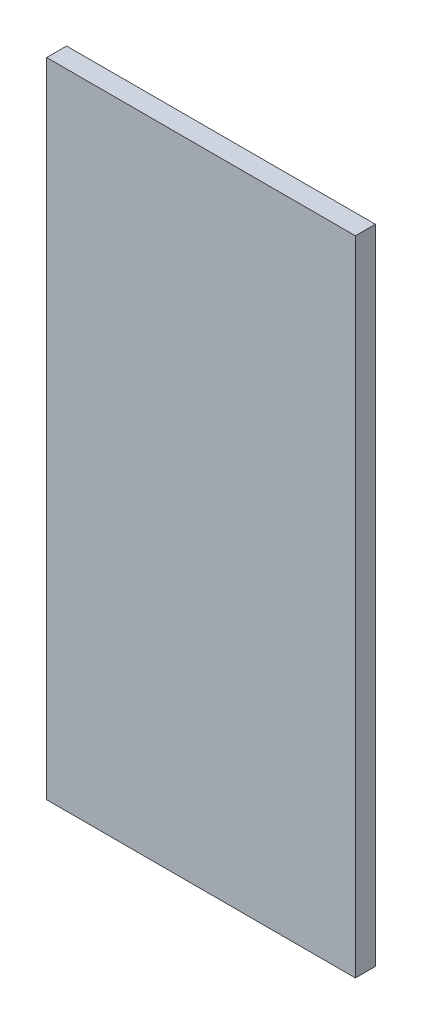
ISO-10303-21;
HEADER;
FILE_DESCRIPTION(('STEP AP214'),'2;1');
FILE_NAME('part.step','',(''),(''),'','','');
FILE_SCHEMA(('AUTOMOTIVE_DESIGN { 1 0 10303 214 1 1 1 1 }'));
ENDSEC;
DATA;
#1=APPLICATION_CONTEXT('core data for automotive mechanical design processes');
#2=APPLICATION_PROTOCOL_DEFINITION('international standard','automotive_design',2000,#1);
#3=PRODUCT_CONTEXT('',#1,'mechanical');
#4=PRODUCT('Part','Part','',(#3));
#5=PRODUCT_RELATED_PRODUCT_CATEGORY('part','',(#4));
#6=PRODUCT_DEFINITION_FORMATION('','',#4);
#7=PRODUCT_DEFINITION_CONTEXT('part definition',#1,'design');
#8=PRODUCT_DEFINITION('design','',#6,#7);
#9=PRODUCT_DEFINITION_SHAPE('','',#8);
#10=(LENGTH_UNIT() NAMED_UNIT(*) SI_UNIT(.MILLI.,.METRE.));
#11=(NAMED_UNIT(*) PLANE_ANGLE_UNIT() SI_UNIT($,.RADIAN.));
#12=(NAMED_UNIT(*) SI_UNIT($,.STERADIAN.) SOLID_ANGLE_UNIT());
#13=UNCERTAINTY_MEASURE_WITH_UNIT(LENGTH_MEASURE(1.E-05),#10,'distance_accuracy_value','');
#14=(GEOMETRIC_REPRESENTATION_CONTEXT(3) GLOBAL_UNCERTAINTY_ASSIGNED_CONTEXT((#13)) GLOBAL_UNIT_ASSIGNED_CONTEXT((#10,
#11,#12)) REPRESENTATION_CONTEXT('',''));
#15=CARTESIAN_POINT('',(0.,0.,0.));
#16=DIRECTION('',(0.,0.,1.));
#17=DIRECTION('',(1.,0.,0.));
#18=AXIS2_PLACEMENT_3D('',#15,#16,#17);
#19=CARTESIAN_POINT('',(90.2419967651367,102.857002258301,0.));
#20=DIRECTION('',(1.,0.,0.));
#21=DIRECTION('',(0.,-1.,0.));
#22=AXIS2_PLACEMENT_3D('',#19,#20,#21);
#23=PLANE('',#22);
#24=DIRECTION('',(0.,-1.,0.));
#25=VECTOR('',#24,1.);
#26=CARTESIAN_POINT('',(90.2419967651367,102.857002258301,0.03556));
#27=LINE('',#26,#25);
#28=CARTESIAN_POINT('',(90.2419967651367,102.857002258301,0.03556));
#29=VERTEX_POINT('',#28);
#30=CARTESIAN_POINT('',(90.2419967651367,101.71199798584,0.03556));
#31=VERTEX_POINT('',#30);
#32=EDGE_CURVE('E11',#29,#31,#27,.T.);
#33=ORIENTED_EDGE('',*,*,#32,.F.);
#34=DIRECTION('',(0.,0.,1.));
#35=VECTOR('',#34,1.);
#36=CARTESIAN_POINT('',(90.2419967651367,102.857002258301,0.));
#37=LINE('',#36,#35);
#38=CARTESIAN_POINT('',(90.2419967651367,102.857002258301,0.));
#39=VERTEX_POINT('',#38);
#40=EDGE_CURVE('E24',#39,#29,#37,.T.);
#41=ORIENTED_EDGE('',*,*,#40,.F.);
#42=DIRECTION('',(0.,-1.,0.));
#43=VECTOR('',#42,1.);
#44=CARTESIAN_POINT('',(90.2419967651367,102.857002258301,0.));
#45=LINE('',#44,#43);
#46=CARTESIAN_POINT('',(90.2419967651367,101.71199798584,0.));
#47=VERTEX_POINT('',#46);
#48=EDGE_CURVE('E75',#39,#47,#45,.T.);
#49=ORIENTED_EDGE('',*,*,#48,.T.);
#50=DIRECTION('',(0.,0.,1.));
#51=VECTOR('',#50,1.);
#52=CARTESIAN_POINT('',(90.2419967651367,101.71199798584,0.));
#53=LINE('',#52,#51);
#54=EDGE_CURVE('E37',#47,#31,#53,.T.);
#55=ORIENTED_EDGE('',*,*,#54,.T.);
#56=EDGE_LOOP('',(#33,#41,#49,#55));
#57=FACE_BOUND('',#56,.T.);
#58=ADVANCED_FACE('F17',(#57),#23,.F.);
#59=CARTESIAN_POINT('',(90.2419967651367,101.71199798584,0.));
#60=DIRECTION('',(0.,1.,0.));
#61=DIRECTION('',(1.,0.,0.));
#62=AXIS2_PLACEMENT_3D('',#59,#60,#61);
#63=PLANE('',#62);
#64=DIRECTION('',(1.,0.,0.));
#65=VECTOR('',#64,1.);
#66=CARTESIAN_POINT('',(90.2419967651367,101.71199798584,0.03556));
#67=LINE('',#66,#65);
#68=CARTESIAN_POINT('',(90.7919998168945,101.71199798584,0.03556));
#69=VERTEX_POINT('',#68);
#70=EDGE_CURVE('E83',#31,#69,#67,.T.);
#71=ORIENTED_EDGE('',*,*,#70,.F.);
#72=ORIENTED_EDGE('',*,*,#54,.F.);
#73=DIRECTION('',(1.,0.,0.));
#74=VECTOR('',#73,1.);
#75=CARTESIAN_POINT('',(90.2419967651367,101.71199798584,0.));
#76=LINE('',#75,#74);
#77=CARTESIAN_POINT('',(90.7919998168945,101.71199798584,0.));
#78=VERTEX_POINT('',#77);
#79=EDGE_CURVE('E81',#47,#78,#76,.T.);
#80=ORIENTED_EDGE('',*,*,#79,.T.);
#81=DIRECTION('',(0.,0.,1.));
#82=VECTOR('',#81,1.);
#83=CARTESIAN_POINT('',(90.7919998168945,101.71199798584,0.));
#84=LINE('',#83,#82);
#85=EDGE_CURVE('E67',#78,#69,#84,.T.);
#86=ORIENTED_EDGE('',*,*,#85,.T.);
#87=EDGE_LOOP('',(#71,#72,#80,#86));
#88=FACE_BOUND('',#87,.T.);
#89=ADVANCED_FACE('F89',(#88),#63,.F.);
#90=CARTESIAN_POINT('',(90.7919998168945,101.71199798584,0.));
#91=DIRECTION('',(-1.,0.,0.));
#92=DIRECTION('',(0.,1.,0.));
#93=AXIS2_PLACEMENT_3D('',#90,#91,#92);
#94=PLANE('',#93);
#95=DIRECTION('',(0.,1.,0.));
#96=VECTOR('',#95,1.);
#97=CARTESIAN_POINT('',(90.7919998168945,101.71199798584,0.03556));
#98=LINE('',#97,#96);
#99=CARTESIAN_POINT('',(90.7919998168945,102.857002258301,0.03556));
#100=VERTEX_POINT('',#99);
#101=EDGE_CURVE('E71',#69,#100,#98,.T.);
#102=ORIENTED_EDGE('',*,*,#101,.F.);
#103=ORIENTED_EDGE('',*,*,#85,.F.);
#104=DIRECTION('',(0.,1.,0.));
#105=VECTOR('',#104,1.);
#106=CARTESIAN_POINT('',(90.7919998168945,101.71199798584,0.));
#107=LINE('',#106,#105);
#108=CARTESIAN_POINT('',(90.7919998168945,102.857002258301,0.));
#109=VERTEX_POINT('',#108);
#110=EDGE_CURVE('E63',#78,#109,#107,.T.);
#111=ORIENTED_EDGE('',*,*,#110,.T.);
#112=DIRECTION('',(0.,0.,1.));
#113=VECTOR('',#112,1.);
#114=CARTESIAN_POINT('',(90.7919998168945,102.857002258301,0.));
#115=LINE('',#114,#113);
#116=EDGE_CURVE('E53',#109,#100,#115,.T.);
#117=ORIENTED_EDGE('',*,*,#116,.T.);
#118=EDGE_LOOP('',(#102,#103,#111,#117));
#119=FACE_BOUND('',#118,.T.);
#120=ADVANCED_FACE('F66',(#119),#94,.F.);
#121=CARTESIAN_POINT('',(90.7919998168945,102.857002258301,0.));
#122=DIRECTION('',(0.,-1.,0.));
#123=DIRECTION('',(-1.,0.,0.));
#124=AXIS2_PLACEMENT_3D('',#121,#122,#123);
#125=PLANE('',#124);
#126=DIRECTION('',(-1.,0.,0.));
#127=VECTOR('',#126,1.);
#128=CARTESIAN_POINT('',(90.7919998168945,102.857002258301,0.03556));
#129=LINE('',#128,#127);
#130=EDGE_CURVE('E59',#100,#29,#129,.T.);
#131=ORIENTED_EDGE('',*,*,#130,.F.);
#132=ORIENTED_EDGE('',*,*,#116,.F.);
#133=DIRECTION('',(-1.,0.,0.));
#134=VECTOR('',#133,1.);
#135=CARTESIAN_POINT('',(90.7919998168945,102.857002258301,0.));
#136=LINE('',#135,#134);
#137=EDGE_CURVE('E57',#109,#39,#136,.T.);
#138=ORIENTED_EDGE('',*,*,#137,.T.);
#139=ORIENTED_EDGE('',*,*,#40,.T.);
#140=EDGE_LOOP('',(#131,#132,#138,#139));
#141=FACE_BOUND('',#140,.T.);
#142=ADVANCED_FACE('F55',(#141),#125,.F.);
#143=CARTESIAN_POINT('',(90.2419967651367,102.857002258301,0.));
#144=DIRECTION('',(0.,0.,-1.));
#145=DIRECTION('',(-1.,0.,0.));
#146=AXIS2_PLACEMENT_3D('',#143,#144,#145);
#147=PLANE('',#146);
#148=ORIENTED_EDGE('',*,*,#137,.F.);
#149=ORIENTED_EDGE('',*,*,#110,.F.);
#150=ORIENTED_EDGE('',*,*,#79,.F.);
#151=ORIENTED_EDGE('',*,*,#48,.F.);
#152=EDGE_LOOP('',(#148,#149,#150,#151));
#153=FACE_BOUND('',#152,.T.);
#154=ADVANCED_FACE('F74',(#153),#147,.T.);
#155=CARTESIAN_POINT('',(90.2419967651367,102.857002258301,0.03556));
#156=DIRECTION('',(0.,0.,-1.));
#157=DIRECTION('',(-1.,0.,0.));
#158=AXIS2_PLACEMENT_3D('',#155,#156,#157);
#159=PLANE('',#158);
#160=ORIENTED_EDGE('',*,*,#32,.T.);
#161=ORIENTED_EDGE('',*,*,#70,.T.);
#162=ORIENTED_EDGE('',*,*,#101,.T.);
#163=ORIENTED_EDGE('',*,*,#130,.T.);
#164=EDGE_LOOP('',(#160,#161,#162,#163));
#165=FACE_BOUND('',#164,.T.);
#166=ADVANCED_FACE('F91',(#165),#159,.F.);
#167=CLOSED_SHELL('',(#58,#89,#120,#142,#154,#166));
#168=MANIFOLD_SOLID_BREP('B1',#167);
#169=ADVANCED_BREP_SHAPE_REPRESENTATION('',(#18,#168),#14);
#170=SHAPE_DEFINITION_REPRESENTATION(#9,#169);
ENDSEC;
END-ISO-10303-21;
